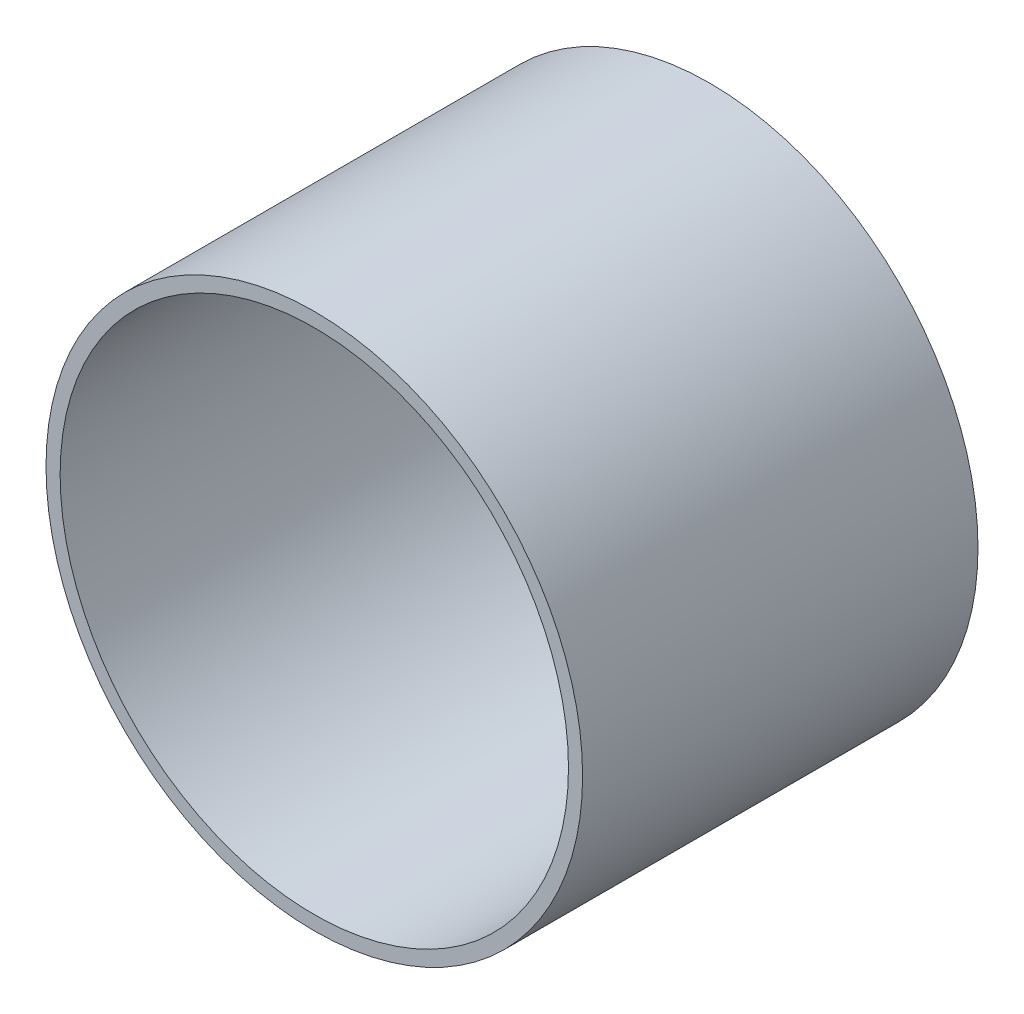
ISO-10303-21;
HEADER;
FILE_DESCRIPTION(('STEP AP214'),'2;1');
FILE_NAME('part.step','',(''),(''),'','','');
FILE_SCHEMA(('AUTOMOTIVE_DESIGN { 1 0 10303 214 1 1 1 1 }'));
ENDSEC;
DATA;
#1=APPLICATION_CONTEXT('core data for automotive mechanical design processes');
#2=APPLICATION_PROTOCOL_DEFINITION('international standard','automotive_design',2000,#1);
#3=PRODUCT_CONTEXT('',#1,'mechanical');
#4=PRODUCT('Part','Part','',(#3));
#5=PRODUCT_RELATED_PRODUCT_CATEGORY('part','',(#4));
#6=PRODUCT_DEFINITION_FORMATION('','',#4);
#7=PRODUCT_DEFINITION_CONTEXT('part definition',#1,'design');
#8=PRODUCT_DEFINITION('design','',#6,#7);
#9=PRODUCT_DEFINITION_SHAPE('','',#8);
#10=(LENGTH_UNIT() NAMED_UNIT(*) SI_UNIT(.MILLI.,.METRE.));
#11=(NAMED_UNIT(*) PLANE_ANGLE_UNIT() SI_UNIT($,.RADIAN.));
#12=(NAMED_UNIT(*) SI_UNIT($,.STERADIAN.) SOLID_ANGLE_UNIT());
#13=UNCERTAINTY_MEASURE_WITH_UNIT(LENGTH_MEASURE(1.E-05),#10,'distance_accuracy_value','');
#14=(GEOMETRIC_REPRESENTATION_CONTEXT(3) GLOBAL_UNCERTAINTY_ASSIGNED_CONTEXT((#13)) GLOBAL_UNIT_ASSIGNED_CONTEXT((#10,
#11,#12)) REPRESENTATION_CONTEXT('',''));
#15=CARTESIAN_POINT('',(0.,0.,0.));
#16=DIRECTION('',(0.,0.,1.));
#17=DIRECTION('',(1.,0.,0.));
#18=AXIS2_PLACEMENT_3D('',#15,#16,#17);
#19=CARTESIAN_POINT('',(0.,0.,14.));
#20=DIRECTION('',(0.,0.,-1.));
#21=DIRECTION('',(-1.,0.,0.));
#22=AXIS2_PLACEMENT_3D('',#19,#20,#21);
#23=CYLINDRICAL_SURFACE('',#22,9.5);
#24=CARTESIAN_POINT('',(0.,0.,14.));
#25=DIRECTION('',(0.,0.,1.));
#26=DIRECTION('',(1.,0.,0.));
#27=AXIS2_PLACEMENT_3D('',#24,#25,#26);
#28=CIRCLE('',#27,9.5);
#29=CARTESIAN_POINT('',(9.5,0.,14.));
#30=VERTEX_POINT('',#29);
#31=EDGE_CURVE('E10',#30,#30,#28,.T.);
#32=ORIENTED_EDGE('',*,*,#31,.F.);
#33=EDGE_LOOP('',(#32));
#34=FACE_BOUND('',#33,.T.);
#35=CARTESIAN_POINT('',(0.,0.,0.));
#36=DIRECTION('',(0.,0.,1.));
#37=DIRECTION('',(1.,0.,0.));
#38=AXIS2_PLACEMENT_3D('',#35,#36,#37);
#39=CIRCLE('',#38,9.5);
#40=CARTESIAN_POINT('',(9.5,0.,0.));
#41=VERTEX_POINT('',#40);
#42=EDGE_CURVE('E35',#41,#41,#39,.T.);
#43=ORIENTED_EDGE('',*,*,#42,.T.);
#44=EDGE_LOOP('',(#43));
#45=FACE_BOUND('',#44,.T.);
#46=ADVANCED_FACE('F32',(#34,#45),#23,.T.);
#47=CARTESIAN_POINT('',(0.,0.,14.));
#48=DIRECTION('',(0.,0.,1.));
#49=DIRECTION('',(1.,0.,0.));
#50=AXIS2_PLACEMENT_3D('',#47,#48,#49);
#51=PLANE('',#50);
#52=CARTESIAN_POINT('',(0.,0.,14.));
#53=DIRECTION('',(0.,0.,1.));
#54=DIRECTION('',(1.,0.,0.));
#55=AXIS2_PLACEMENT_3D('',#52,#53,#54);
#56=CIRCLE('',#55,9.);
#57=CARTESIAN_POINT('',(9.,0.,14.));
#58=VERTEX_POINT('',#57);
#59=EDGE_CURVE('E44',#58,#58,#56,.T.);
#60=ORIENTED_EDGE('',*,*,#59,.F.);
#61=EDGE_LOOP('',(#60));
#62=FACE_BOUND('',#61,.T.);
#63=ORIENTED_EDGE('',*,*,#31,.T.);
#64=EDGE_LOOP('',(#63));
#65=FACE_BOUND('',#64,.T.);
#66=ADVANCED_FACE('F59',(#62,#65),#51,.T.);
#67=CARTESIAN_POINT('',(0.,0.,0.));
#68=DIRECTION('',(0.,0.,1.));
#69=DIRECTION('',(1.,0.,0.));
#70=AXIS2_PLACEMENT_3D('',#67,#68,#69);
#71=PLANE('',#70);
#72=ORIENTED_EDGE('',*,*,#42,.F.);
#73=EDGE_LOOP('',(#72));
#74=FACE_BOUND('',#73,.T.);
#75=ADVANCED_FACE('F55',(#74),#71,.F.);
#76=CARTESIAN_POINT('',(0.,0.,1.));
#77=DIRECTION('',(0.,0.,1.));
#78=DIRECTION('',(1.,0.,0.));
#79=AXIS2_PLACEMENT_3D('',#76,#77,#78);
#80=CYLINDRICAL_SURFACE('',#79,9.);
#81=CARTESIAN_POINT('',(0.,0.,1.));
#82=DIRECTION('',(0.,0.,1.));
#83=DIRECTION('',(1.,0.,0.));
#84=AXIS2_PLACEMENT_3D('',#81,#82,#83);
#85=CIRCLE('',#84,9.);
#86=CARTESIAN_POINT('',(9.,0.,1.));
#87=VERTEX_POINT('',#86);
#88=EDGE_CURVE('E42',#87,#87,#85,.T.);
#89=ORIENTED_EDGE('',*,*,#88,.F.);
#90=EDGE_LOOP('',(#89));
#91=FACE_BOUND('',#90,.T.);
#92=ORIENTED_EDGE('',*,*,#59,.T.);
#93=EDGE_LOOP('',(#92));
#94=FACE_BOUND('',#93,.T.);
#95=ADVANCED_FACE('F52',(#91,#94),#80,.F.);
#96=CARTESIAN_POINT('',(0.,0.,1.));
#97=DIRECTION('',(0.,0.,1.));
#98=DIRECTION('',(1.,0.,0.));
#99=AXIS2_PLACEMENT_3D('',#96,#97,#98);
#100=PLANE('',#99);
#101=ORIENTED_EDGE('',*,*,#88,.T.);
#102=EDGE_LOOP('',(#101));
#103=FACE_BOUND('',#102,.T.);
#104=ADVANCED_FACE('F50',(#103),#100,.T.);
#105=CLOSED_SHELL('',(#46,#66,#75,#95,#104));
#106=MANIFOLD_SOLID_BREP('B2',#105);
#107=ADVANCED_BREP_SHAPE_REPRESENTATION('',(#18,#106),#14);
#108=SHAPE_DEFINITION_REPRESENTATION(#9,#107);
ENDSEC;
END-ISO-10303-21;
